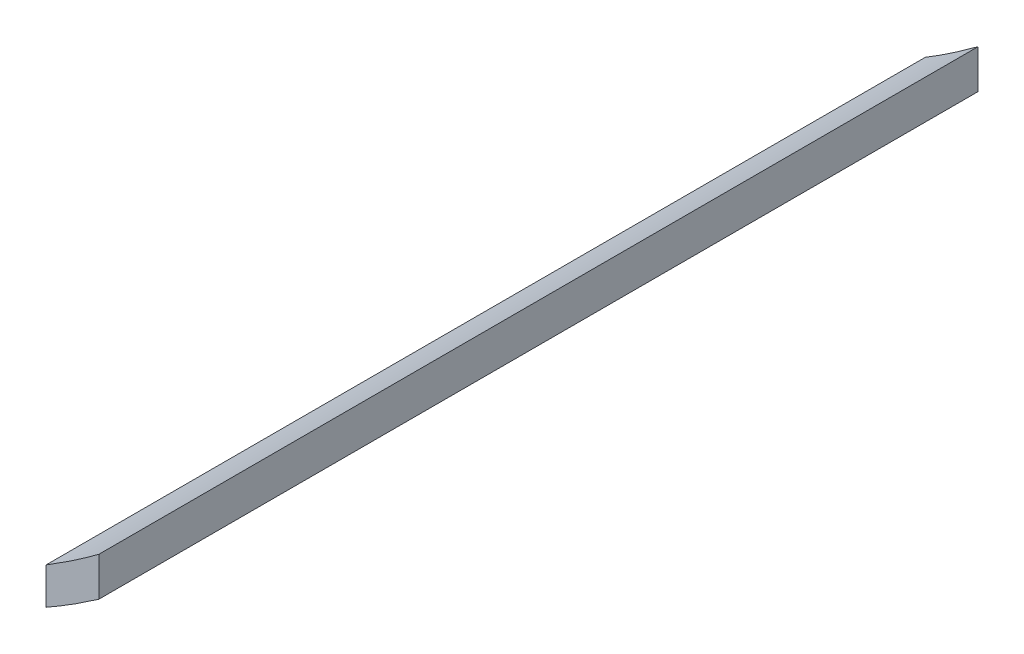
ISO-10303-21;
HEADER;
FILE_DESCRIPTION(('STEP AP214'),'2;1');
FILE_NAME('part.step','',(''),(''),'','','');
FILE_SCHEMA(('AUTOMOTIVE_DESIGN { 1 0 10303 214 1 1 1 1 }'));
ENDSEC;
DATA;
#1=APPLICATION_CONTEXT('core data for automotive mechanical design processes');
#2=APPLICATION_PROTOCOL_DEFINITION('international standard','automotive_design',2000,#1);
#3=PRODUCT_CONTEXT('',#1,'mechanical');
#4=PRODUCT('Part','Part','',(#3));
#5=PRODUCT_RELATED_PRODUCT_CATEGORY('part','',(#4));
#6=PRODUCT_DEFINITION_FORMATION('','',#4);
#7=PRODUCT_DEFINITION_CONTEXT('part definition',#1,'design');
#8=PRODUCT_DEFINITION('design','',#6,#7);
#9=PRODUCT_DEFINITION_SHAPE('','',#8);
#10=(LENGTH_UNIT() NAMED_UNIT(*) SI_UNIT(.MILLI.,.METRE.));
#11=(NAMED_UNIT(*) PLANE_ANGLE_UNIT() SI_UNIT($,.RADIAN.));
#12=(NAMED_UNIT(*) SI_UNIT($,.STERADIAN.) SOLID_ANGLE_UNIT());
#13=UNCERTAINTY_MEASURE_WITH_UNIT(LENGTH_MEASURE(1.E-05),#10,'distance_accuracy_value','');
#14=(GEOMETRIC_REPRESENTATION_CONTEXT(3) GLOBAL_UNCERTAINTY_ASSIGNED_CONTEXT((#13)) GLOBAL_UNIT_ASSIGNED_CONTEXT((#10,
#11,#12)) REPRESENTATION_CONTEXT('',''));
#15=CARTESIAN_POINT('',(0.,0.,0.));
#16=DIRECTION('',(0.,0.,1.));
#17=DIRECTION('',(1.,0.,0.));
#18=AXIS2_PLACEMENT_3D('',#15,#16,#17);
#19=CARTESIAN_POINT('',(124.702606635071,-48.5425651877576,50.));
#20=CARTESIAN_POINT('',(124.140009695282,-48.9570113430097,50.));
#21=CARTESIAN_POINT('',(123.569130860204,-49.3593820853901,50.));
#22=CARTESIAN_POINT('',(122.565266452862,-50.0277418478877,50.));
#23=CARTESIAN_POINT('',(122.137178932463,-50.3008724698325,50.));
#24=CARTESIAN_POINT('',(121.702606635071,-50.5645479662495,50.));
#25=B_SPLINE_CURVE_WITH_KNOTS('',3,(#19,#20,#21,#22,#23,#24),.UNSPECIFIED.,.F.,.F.,(4,2,4),
(0.114062220421862,0.249999999999999,0.348787923125498),.UNSPECIFIED.);
#26=DIRECTION('',(0.,0.,-1.));
#27=VECTOR('',#26,1.);
#28=SURFACE_OF_LINEAR_EXTRUSION('',#25,#27);
#29=CARTESIAN_POINT('',(124.702606635071,-48.5425651877576,0.));
#30=CARTESIAN_POINT('',(124.140009695282,-48.9570113430097,0.));
#31=CARTESIAN_POINT('',(123.569130860204,-49.3593820853901,0.));
#32=CARTESIAN_POINT('',(122.565266452862,-50.0277418478877,0.));
#33=CARTESIAN_POINT('',(122.137178932463,-50.3008724698325,0.));
#34=CARTESIAN_POINT('',(121.702606635071,-50.5645479662495,0.));
#35=B_SPLINE_CURVE_WITH_KNOTS('',3,(#29,#30,#31,#32,#33,#34),.UNSPECIFIED.,.F.,.F.,(4,2,4),
(0.114062220421862,0.249999999999999,0.348787923125498),.UNSPECIFIED.);
#36=CARTESIAN_POINT('',(124.702606635071,-48.5425651877576,0.));
#37=VERTEX_POINT('',#36);
#38=CARTESIAN_POINT('',(121.702606635071,-50.5645479662495,0.));
#39=VERTEX_POINT('',#38);
#40=EDGE_CURVE('E202',#37,#39,#35,.T.);
#41=ORIENTED_EDGE('',*,*,#40,.T.);
#42=DIRECTION('',(0.,0.,-1.));
#43=VECTOR('',#42,1.);
#44=CARTESIAN_POINT('',(121.702606635071,-50.5645479662495,50.));
#45=LINE('',#44,#43);
#46=CARTESIAN_POINT('',(121.702606635071,-50.5645479662495,50.));
#47=VERTEX_POINT('',#46);
#48=EDGE_CURVE('E11',#47,#39,#45,.T.);
#49=ORIENTED_EDGE('',*,*,#48,.F.);
#50=CARTESIAN_POINT('',(121.702606635071,-50.5645479662495,50.));
#51=CARTESIAN_POINT('',(122.137178932463,-50.3008724698325,50.));
#52=CARTESIAN_POINT('',(122.565266452862,-50.0277418478877,50.));
#53=CARTESIAN_POINT('',(123.569130860204,-49.3593820853901,50.));
#54=CARTESIAN_POINT('',(124.140009695282,-48.9570113430097,50.));
#55=CARTESIAN_POINT('',(124.702606635071,-48.5425651877576,50.));
#56=B_SPLINE_CURVE_WITH_KNOTS('',3,(#50,#51,#52,#53,#54,#55),.UNSPECIFIED.,.F.,.F.,(4,2,4),
(0.114062220421862,0.212850143547361,0.348787923125498),.UNSPECIFIED.);
#57=CARTESIAN_POINT('',(124.702606635071,-48.5425651877576,50.));
#58=VERTEX_POINT('',#57);
#59=EDGE_CURVE('E99',#58,#47,#56,.F.);
#60=ORIENTED_EDGE('',*,*,#59,.F.);
#61=DIRECTION('',(0.,0.,-1.));
#62=VECTOR('',#61,1.);
#63=CARTESIAN_POINT('',(124.702606635071,-48.5425651877576,50.));
#64=LINE('',#63,#62);
#65=EDGE_CURVE('E187',#58,#37,#64,.T.);
#66=ORIENTED_EDGE('',*,*,#65,.T.);
#67=EDGE_LOOP('',(#41,#49,#60,#66));
#68=FACE_BOUND('',#67,.T.);
#69=ADVANCED_FACE('F39',(#68),#28,.F.);
#70=CARTESIAN_POINT('',(121.702606635071,-50.5645479662495,50.));
#71=DIRECTION('',(1.,0.,0.));
#72=DIRECTION('',(0.,1.,0.));
#73=AXIS2_PLACEMENT_3D('',#70,#71,#72);
#74=PLANE('',#73);
#75=DIRECTION('',(0.,-1.,0.));
#76=VECTOR('',#75,1.);
#77=CARTESIAN_POINT('',(121.702606635071,-50.5645479662495,0.));
#78=LINE('',#77,#76);
#79=CARTESIAN_POINT('',(121.702606635071,-52.6500761993356,0.));
#80=VERTEX_POINT('',#79);
#81=EDGE_CURVE('E105',#39,#80,#78,.T.);
#82=ORIENTED_EDGE('',*,*,#81,.T.);
#83=DIRECTION('',(0.,0.,-1.));
#84=VECTOR('',#83,1.);
#85=CARTESIAN_POINT('',(121.702606635071,-52.6500761993356,50.));
#86=LINE('',#85,#84);
#87=CARTESIAN_POINT('',(121.702606635071,-52.6500761993356,50.));
#88=VERTEX_POINT('',#87);
#89=EDGE_CURVE('E53',#88,#80,#86,.T.);
#90=ORIENTED_EDGE('',*,*,#89,.F.);
#91=DIRECTION('',(0.,-1.,0.));
#92=VECTOR('',#91,1.);
#93=CARTESIAN_POINT('',(121.702606635071,-50.5645479662495,50.));
#94=LINE('',#93,#92);
#95=EDGE_CURVE('E93',#47,#88,#94,.T.);
#96=ORIENTED_EDGE('',*,*,#95,.F.);
#97=ORIENTED_EDGE('',*,*,#48,.T.);
#98=EDGE_LOOP('',(#82,#90,#96,#97));
#99=FACE_BOUND('',#98,.T.);
#100=ADVANCED_FACE('F104',(#99),#74,.F.);
#101=CARTESIAN_POINT('',(121.702606635071,-52.6500761993356,50.));
#102=CARTESIAN_POINT('',(122.143324793172,-52.4015421511258,50.));
#103=CARTESIAN_POINT('',(122.578079075743,-52.1427605373036,50.));
#104=CARTESIAN_POINT('',(123.58139662693,-51.517175338616,50.));
#105=CARTESIAN_POINT('',(124.14616311308,-51.1431405595152,50.));
#106=CARTESIAN_POINT('',(124.702606635071,-50.7562014190225,50.));
#107=B_SPLINE_CURVE_WITH_KNOTS('',3,(#101,#102,#103,#104,#105,#106),.UNSPECIFIED.,.F.,.F.,(4,2,
4),(0.649205424795794,0.750000000000001,0.88522318251672),.UNSPECIFIED.);
#108=DIRECTION('',(0.,0.,-1.));
#109=VECTOR('',#108,1.);
#110=SURFACE_OF_LINEAR_EXTRUSION('',#107,#109);
#111=CARTESIAN_POINT('',(121.702606635071,-52.6500761993356,0.));
#112=CARTESIAN_POINT('',(122.143324793172,-52.4015421511258,0.));
#113=CARTESIAN_POINT('',(122.578079075743,-52.1427605373036,0.));
#114=CARTESIAN_POINT('',(123.58139662693,-51.517175338616,0.));
#115=CARTESIAN_POINT('',(124.14616311308,-51.1431405595152,0.));
#116=CARTESIAN_POINT('',(124.702606635071,-50.7562014190225,0.));
#117=B_SPLINE_CURVE_WITH_KNOTS('',3,(#111,#112,#113,#114,#115,#116),.UNSPECIFIED.,.F.,.F.,(4,2,
4),(0.649205424795794,0.750000000000001,0.88522318251672),.UNSPECIFIED.);
#118=CARTESIAN_POINT('',(124.702606635071,-50.7562014190225,0.));
#119=VERTEX_POINT('',#118);
#120=EDGE_CURVE('E79',#80,#119,#117,.T.);
#121=ORIENTED_EDGE('',*,*,#120,.T.);
#122=DIRECTION('',(0.,0.,-1.));
#123=VECTOR('',#122,1.);
#124=CARTESIAN_POINT('',(124.702606635071,-50.7562014190225,50.));
#125=LINE('',#124,#123);
#126=CARTESIAN_POINT('',(124.702606635071,-50.7562014190225,50.));
#127=VERTEX_POINT('',#126);
#128=EDGE_CURVE('E107',#127,#119,#125,.T.);
#129=ORIENTED_EDGE('',*,*,#128,.F.);
#130=CARTESIAN_POINT('',(124.702606635071,-50.7562014190225,50.));
#131=CARTESIAN_POINT('',(124.14616311308,-51.1431405595152,50.));
#132=CARTESIAN_POINT('',(123.58139662693,-51.517175338616,50.));
#133=CARTESIAN_POINT('',(122.578079075743,-52.1427605373036,50.));
#134=CARTESIAN_POINT('',(122.143324793172,-52.4015421511258,50.));
#135=CARTESIAN_POINT('',(121.702606635071,-52.6500761993356,50.));
#136=B_SPLINE_CURVE_WITH_KNOTS('',3,(#130,#131,#132,#133,#134,#135),.UNSPECIFIED.,.F.,.F.,(4,2,
4),(0.649205424795794,0.784428607312513,0.88522318251672),.UNSPECIFIED.);
#137=EDGE_CURVE('E96',#88,#127,#136,.F.);
#138=ORIENTED_EDGE('',*,*,#137,.F.);
#139=ORIENTED_EDGE('',*,*,#89,.T.);
#140=EDGE_LOOP('',(#121,#129,#138,#139));
#141=FACE_BOUND('',#140,.T.);
#142=ADVANCED_FACE('F110',(#141),#110,.F.);
#143=CARTESIAN_POINT('',(124.702606635071,-48.5425651877576,50.));
#144=DIRECTION('',(-1.,0.,0.));
#145=DIRECTION('',(0.,-1.,0.));
#146=AXIS2_PLACEMENT_3D('',#143,#144,#145);
#147=PLANE('',#146);
#148=DIRECTION('',(0.,1.,0.));
#149=VECTOR('',#148,1.);
#150=CARTESIAN_POINT('',(124.702606635071,-48.5425651877576,0.));
#151=LINE('',#150,#149);
#152=EDGE_CURVE('E86',#119,#37,#151,.T.);
#153=ORIENTED_EDGE('',*,*,#152,.T.);
#154=ORIENTED_EDGE('',*,*,#65,.F.);
#155=DIRECTION('',(0.,1.,0.));
#156=VECTOR('',#155,1.);
#157=CARTESIAN_POINT('',(124.702606635071,-48.5425651877576,50.));
#158=LINE('',#157,#156);
#159=EDGE_CURVE('E62',#127,#58,#158,.T.);
#160=ORIENTED_EDGE('',*,*,#159,.F.);
#161=ORIENTED_EDGE('',*,*,#128,.T.);
#162=EDGE_LOOP('',(#153,#154,#160,#161));
#163=FACE_BOUND('',#162,.T.);
#164=ADVANCED_FACE('F130',(#163),#147,.F.);
#165=CARTESIAN_POINT('',(123.22549735006,-49.5869323714036,50.));
#166=DIRECTION('',(0.,0.,1.));
#167=DIRECTION('',(1.,0.,0.));
#168=AXIS2_PLACEMENT_3D('',#165,#166,#167);
#169=PLANE('',#168);
#170=ORIENTED_EDGE('',*,*,#59,.T.);
#171=ORIENTED_EDGE('',*,*,#95,.T.);
#172=ORIENTED_EDGE('',*,*,#137,.T.);
#173=ORIENTED_EDGE('',*,*,#159,.T.);
#174=EDGE_LOOP('',(#170,#171,#172,#173));
#175=FACE_BOUND('',#174,.T.);
#176=ADVANCED_FACE('F94',(#175),#169,.T.);
#177=CARTESIAN_POINT('',(123.22549735006,-49.5869323714036,0.));
#178=DIRECTION('',(0.,0.,1.));
#179=DIRECTION('',(1.,0.,0.));
#180=AXIS2_PLACEMENT_3D('',#177,#178,#179);
#181=PLANE('',#180);
#182=ORIENTED_EDGE('',*,*,#40,.F.);
#183=ORIENTED_EDGE('',*,*,#152,.F.);
#184=ORIENTED_EDGE('',*,*,#120,.F.);
#185=ORIENTED_EDGE('',*,*,#81,.F.);
#186=EDGE_LOOP('',(#182,#183,#184,#185));
#187=FACE_BOUND('',#186,.T.);
#188=ADVANCED_FACE('F160',(#187),#181,.F.);
#189=CLOSED_SHELL('',(#69,#100,#142,#164,#176,#188));
#190=MANIFOLD_SOLID_BREP('B2',#189);
#191=ADVANCED_BREP_SHAPE_REPRESENTATION('',(#18,#190),#14);
#192=SHAPE_DEFINITION_REPRESENTATION(#9,#191);
ENDSEC;
END-ISO-10303-21;
